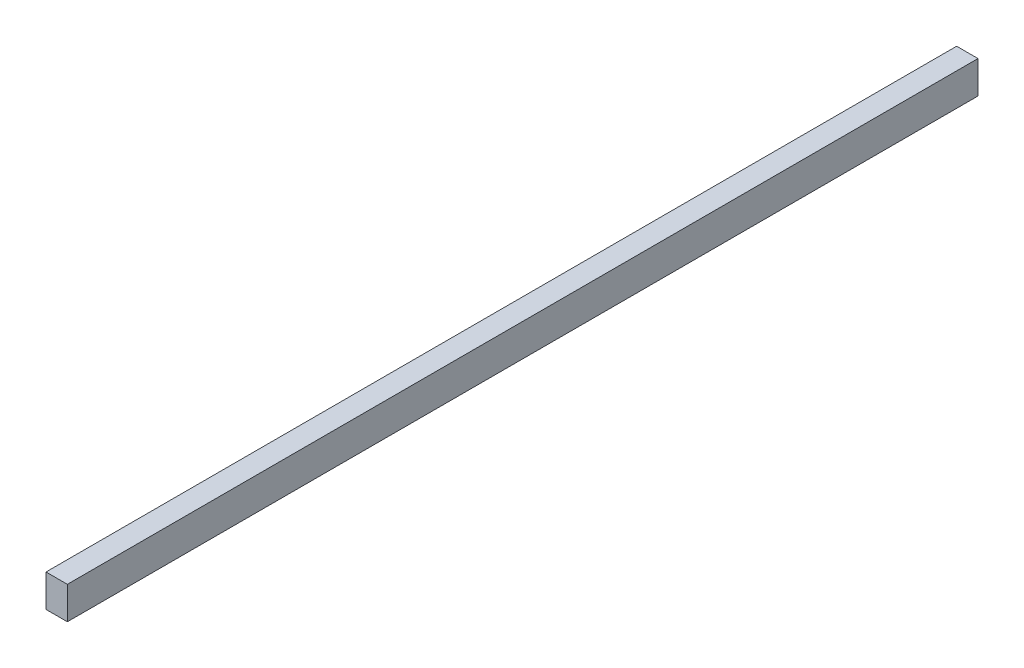
ISO-10303-21;
HEADER;
FILE_DESCRIPTION(('STEP AP214'),'2;1');
FILE_NAME('part.step','',(''),(''),'','','');
FILE_SCHEMA(('AUTOMOTIVE_DESIGN { 1 0 10303 214 1 1 1 1 }'));
ENDSEC;
DATA;
#1=APPLICATION_CONTEXT('core data for automotive mechanical design processes');
#2=APPLICATION_PROTOCOL_DEFINITION('international standard','automotive_design',2000,#1);
#3=PRODUCT_CONTEXT('',#1,'mechanical');
#4=PRODUCT('Part','Part','',(#3));
#5=PRODUCT_RELATED_PRODUCT_CATEGORY('part','',(#4));
#6=PRODUCT_DEFINITION_FORMATION('','',#4);
#7=PRODUCT_DEFINITION_CONTEXT('part definition',#1,'design');
#8=PRODUCT_DEFINITION('design','',#6,#7);
#9=PRODUCT_DEFINITION_SHAPE('','',#8);
#10=(LENGTH_UNIT() NAMED_UNIT(*) SI_UNIT(.MILLI.,.METRE.));
#11=(NAMED_UNIT(*) PLANE_ANGLE_UNIT() SI_UNIT($,.RADIAN.));
#12=(NAMED_UNIT(*) SI_UNIT($,.STERADIAN.) SOLID_ANGLE_UNIT());
#13=UNCERTAINTY_MEASURE_WITH_UNIT(LENGTH_MEASURE(1.E-05),#10,'distance_accuracy_value','');
#14=(GEOMETRIC_REPRESENTATION_CONTEXT(3) GLOBAL_UNCERTAINTY_ASSIGNED_CONTEXT((#13)) GLOBAL_UNIT_ASSIGNED_CONTEXT((#10,
#11,#12)) REPRESENTATION_CONTEXT('',''));
#15=CARTESIAN_POINT('',(0.,0.,0.));
#16=DIRECTION('',(0.,0.,1.));
#17=DIRECTION('',(1.,0.,0.));
#18=AXIS2_PLACEMENT_3D('',#15,#16,#17);
#19=CARTESIAN_POINT('',(-8.69510276310364,34.9830288323159,1625.6));
#20=DIRECTION('',(1.,0.,0.));
#21=DIRECTION('',(0.,1.,0.));
#22=AXIS2_PLACEMENT_3D('',#19,#20,#21);
#23=PLANE('',#22);
#24=DIRECTION('',(0.,-1.,0.));
#25=VECTOR('',#24,1.);
#26=CARTESIAN_POINT('',(-8.69510276310364,34.9830288323159,0.));
#27=LINE('',#26,#25);
#28=CARTESIAN_POINT('',(-8.69510276310364,34.9830288323159,0.));
#29=VERTEX_POINT('',#28);
#30=CARTESIAN_POINT('',(-8.69510276310363,-22.9607211676841,0.));
#31=VERTEX_POINT('',#30);
#32=EDGE_CURVE('E95',#29,#31,#27,.T.);
#33=ORIENTED_EDGE('',*,*,#32,.T.);
#34=DIRECTION('',(0.,0.,-1.));
#35=VECTOR('',#34,1.);
#36=CARTESIAN_POINT('',(-8.69510276310363,-22.9607211676841,1625.6));
#37=LINE('',#36,#35);
#38=CARTESIAN_POINT('',(-8.69510276310363,-22.9607211676841,1625.6));
#39=VERTEX_POINT('',#38);
#40=EDGE_CURVE('E11',#39,#31,#37,.T.);
#41=ORIENTED_EDGE('',*,*,#40,.F.);
#42=DIRECTION('',(0.,-1.,0.));
#43=VECTOR('',#42,1.);
#44=CARTESIAN_POINT('',(-8.69510276310364,34.9830288323159,1625.6));
#45=LINE('',#44,#43);
#46=CARTESIAN_POINT('',(-8.69510276310364,34.9830288323159,1625.6));
#47=VERTEX_POINT('',#46);
#48=EDGE_CURVE('E83',#47,#39,#45,.T.);
#49=ORIENTED_EDGE('',*,*,#48,.F.);
#50=DIRECTION('',(0.,0.,-1.));
#51=VECTOR('',#50,1.);
#52=CARTESIAN_POINT('',(-8.69510276310364,34.9830288323159,1625.6));
#53=LINE('',#52,#51);
#54=EDGE_CURVE('E91',#47,#29,#53,.T.);
#55=ORIENTED_EDGE('',*,*,#54,.T.);
#56=EDGE_LOOP('',(#33,#41,#49,#55));
#57=FACE_BOUND('',#56,.T.);
#58=ADVANCED_FACE('F32',(#57),#23,.F.);
#59=CARTESIAN_POINT('',(-8.69510276310363,-22.9607211676841,1625.6));
#60=DIRECTION('',(0.,1.,0.));
#61=DIRECTION('',(0.,0.,1.));
#62=AXIS2_PLACEMENT_3D('',#59,#60,#61);
#63=PLANE('',#62);
#64=DIRECTION('',(1.,0.,0.));
#65=VECTOR('',#64,1.);
#66=CARTESIAN_POINT('',(-8.69510276310363,-22.9607211676841,0.));
#67=LINE('',#66,#65);
#68=CARTESIAN_POINT('',(29.4048972368964,-22.9607211676841,0.));
#69=VERTEX_POINT('',#68);
#70=EDGE_CURVE('E87',#31,#69,#67,.T.);
#71=ORIENTED_EDGE('',*,*,#70,.T.);
#72=DIRECTION('',(0.,0.,-1.));
#73=VECTOR('',#72,1.);
#74=CARTESIAN_POINT('',(29.4048972368964,-22.9607211676841,1625.6));
#75=LINE('',#74,#73);
#76=CARTESIAN_POINT('',(29.4048972368964,-22.9607211676841,1625.6));
#77=VERTEX_POINT('',#76);
#78=EDGE_CURVE('E40',#77,#69,#75,.T.);
#79=ORIENTED_EDGE('',*,*,#78,.F.);
#80=DIRECTION('',(1.,0.,0.));
#81=VECTOR('',#80,1.);
#82=CARTESIAN_POINT('',(-8.69510276310363,-22.9607211676841,1625.6));
#83=LINE('',#82,#81);
#84=EDGE_CURVE('E78',#39,#77,#83,.T.);
#85=ORIENTED_EDGE('',*,*,#84,.F.);
#86=ORIENTED_EDGE('',*,*,#40,.T.);
#87=EDGE_LOOP('',(#71,#79,#85,#86));
#88=FACE_BOUND('',#87,.T.);
#89=ADVANCED_FACE('F86',(#88),#63,.F.);
#90=CARTESIAN_POINT('',(29.4048972368964,34.9830288323159,1625.6));
#91=DIRECTION('',(-1.,0.,0.));
#92=DIRECTION('',(0.,-1.,0.));
#93=AXIS2_PLACEMENT_3D('',#90,#91,#92);
#94=PLANE('',#93);
#95=DIRECTION('',(0.,1.,0.));
#96=VECTOR('',#95,1.);
#97=CARTESIAN_POINT('',(29.4048972368964,34.9830288323159,0.));
#98=LINE('',#97,#96);
#99=CARTESIAN_POINT('',(29.4048972368964,34.9830288323159,0.));
#100=VERTEX_POINT('',#99);
#101=EDGE_CURVE('E65',#69,#100,#98,.T.);
#102=ORIENTED_EDGE('',*,*,#101,.T.);
#103=DIRECTION('',(0.,0.,-1.));
#104=VECTOR('',#103,1.);
#105=CARTESIAN_POINT('',(29.4048972368964,34.9830288323159,1625.6));
#106=LINE('',#105,#104);
#107=CARTESIAN_POINT('',(29.4048972368964,34.9830288323159,1625.6));
#108=VERTEX_POINT('',#107);
#109=EDGE_CURVE('E88',#108,#100,#106,.T.);
#110=ORIENTED_EDGE('',*,*,#109,.F.);
#111=DIRECTION('',(0.,1.,0.));
#112=VECTOR('',#111,1.);
#113=CARTESIAN_POINT('',(29.4048972368964,34.9830288323159,1625.6));
#114=LINE('',#113,#112);
#115=EDGE_CURVE('E81',#77,#108,#114,.T.);
#116=ORIENTED_EDGE('',*,*,#115,.F.);
#117=ORIENTED_EDGE('',*,*,#78,.T.);
#118=EDGE_LOOP('',(#102,#110,#116,#117));
#119=FACE_BOUND('',#118,.T.);
#120=ADVANCED_FACE('F89',(#119),#94,.F.);
#121=CARTESIAN_POINT('',(-8.69510276310364,34.9830288323159,1625.6));
#122=DIRECTION('',(0.,-1.,0.));
#123=DIRECTION('',(0.,0.,-1.));
#124=AXIS2_PLACEMENT_3D('',#121,#122,#123);
#125=PLANE('',#124);
#126=DIRECTION('',(-1.,0.,0.));
#127=VECTOR('',#126,1.);
#128=CARTESIAN_POINT('',(-8.69510276310364,34.9830288323159,0.));
#129=LINE('',#128,#127);
#130=EDGE_CURVE('E71',#100,#29,#129,.T.);
#131=ORIENTED_EDGE('',*,*,#130,.T.);
#132=ORIENTED_EDGE('',*,*,#54,.F.);
#133=DIRECTION('',(-1.,0.,0.));
#134=VECTOR('',#133,1.);
#135=CARTESIAN_POINT('',(-8.69510276310364,34.9830288323159,1625.6));
#136=LINE('',#135,#134);
#137=EDGE_CURVE('E48',#108,#47,#136,.T.);
#138=ORIENTED_EDGE('',*,*,#137,.F.);
#139=ORIENTED_EDGE('',*,*,#109,.T.);
#140=EDGE_LOOP('',(#131,#132,#138,#139));
#141=FACE_BOUND('',#140,.T.);
#142=ADVANCED_FACE('F102',(#141),#125,.F.);
#143=CARTESIAN_POINT('',(0.,0.,1625.6));
#144=DIRECTION('',(0.,0.,1.));
#145=DIRECTION('',(1.,0.,0.));
#146=AXIS2_PLACEMENT_3D('',#143,#144,#145);
#147=PLANE('',#146);
#148=ORIENTED_EDGE('',*,*,#48,.T.);
#149=ORIENTED_EDGE('',*,*,#84,.T.);
#150=ORIENTED_EDGE('',*,*,#115,.T.);
#151=ORIENTED_EDGE('',*,*,#137,.T.);
#152=EDGE_LOOP('',(#148,#149,#150,#151));
#153=FACE_BOUND('',#152,.T.);
#154=ADVANCED_FACE('F79',(#153),#147,.T.);
#155=CARTESIAN_POINT('',(0.,0.,0.));
#156=DIRECTION('',(0.,0.,1.));
#157=DIRECTION('',(1.,0.,0.));
#158=AXIS2_PLACEMENT_3D('',#155,#156,#157);
#159=PLANE('',#158);
#160=ORIENTED_EDGE('',*,*,#32,.F.);
#161=ORIENTED_EDGE('',*,*,#130,.F.);
#162=ORIENTED_EDGE('',*,*,#101,.F.);
#163=ORIENTED_EDGE('',*,*,#70,.F.);
#164=EDGE_LOOP('',(#160,#161,#162,#163));
#165=FACE_BOUND('',#164,.T.);
#166=ADVANCED_FACE('F105',(#165),#159,.F.);
#167=CLOSED_SHELL('',(#58,#89,#120,#142,#154,#166));
#168=MANIFOLD_SOLID_BREP('B2',#167);
#169=ADVANCED_BREP_SHAPE_REPRESENTATION('',(#18,#168),#14);
#170=SHAPE_DEFINITION_REPRESENTATION(#9,#169);
ENDSEC;
END-ISO-10303-21;
